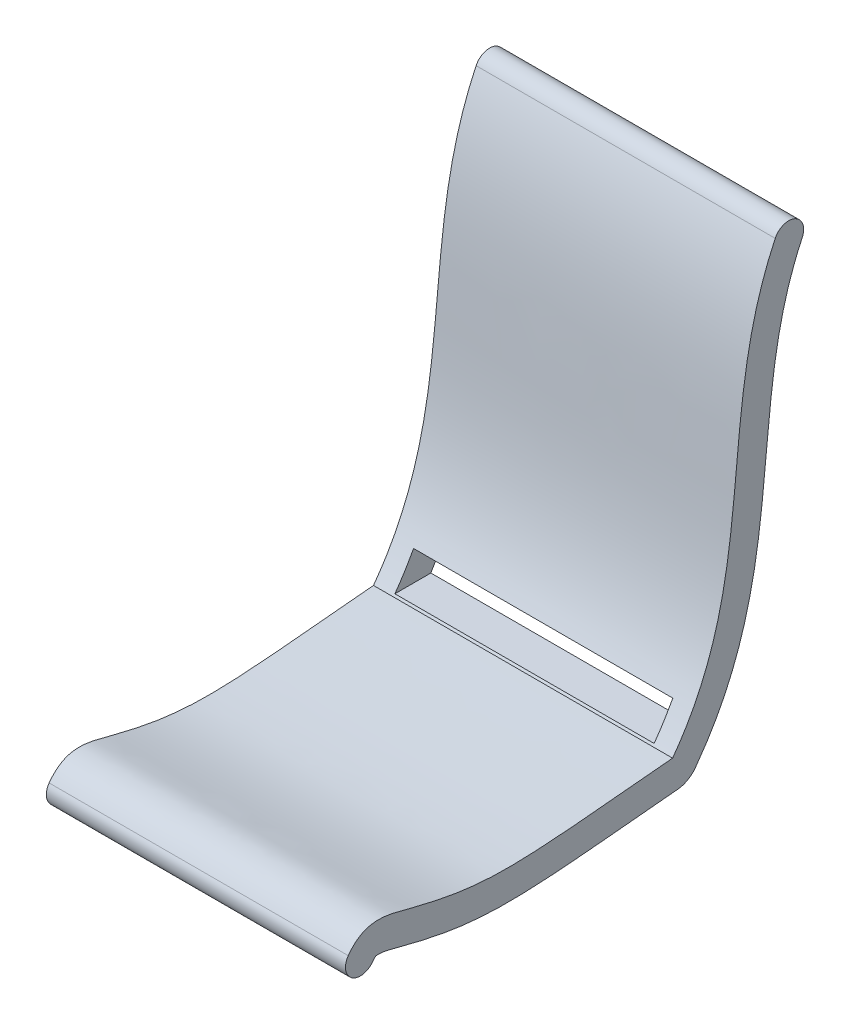
ISO-10303-21;
HEADER;
FILE_DESCRIPTION(('STEP AP214'),'2;1');
FILE_NAME('part.step','',(''),(''),'','','');
FILE_SCHEMA(('AUTOMOTIVE_DESIGN { 1 0 10303 214 1 1 1 1 }'));
ENDSEC;
DATA;
#1=APPLICATION_CONTEXT('core data for automotive mechanical design processes');
#2=APPLICATION_PROTOCOL_DEFINITION('international standard','automotive_design',2000,#1);
#3=PRODUCT_CONTEXT('',#1,'mechanical');
#4=PRODUCT('Part','Part','',(#3));
#5=PRODUCT_RELATED_PRODUCT_CATEGORY('part','',(#4));
#6=PRODUCT_DEFINITION_FORMATION('','',#4);
#7=PRODUCT_DEFINITION_CONTEXT('part definition',#1,'design');
#8=PRODUCT_DEFINITION('design','',#6,#7);
#9=PRODUCT_DEFINITION_SHAPE('','',#8);
#10=(LENGTH_UNIT() NAMED_UNIT(*) SI_UNIT(.MILLI.,.METRE.));
#11=(NAMED_UNIT(*) PLANE_ANGLE_UNIT() SI_UNIT($,.RADIAN.));
#12=(NAMED_UNIT(*) SI_UNIT($,.STERADIAN.) SOLID_ANGLE_UNIT());
#13=UNCERTAINTY_MEASURE_WITH_UNIT(LENGTH_MEASURE(1.E-05),#10,'distance_accuracy_value','');
#14=(GEOMETRIC_REPRESENTATION_CONTEXT(3) GLOBAL_UNCERTAINTY_ASSIGNED_CONTEXT((#13)) GLOBAL_UNIT_ASSIGNED_CONTEXT((#10,
#11,#12)) REPRESENTATION_CONTEXT('',''));
#15=CARTESIAN_POINT('',(0.,0.,0.));
#16=DIRECTION('',(0.,0.,1.));
#17=DIRECTION('',(1.,0.,0.));
#18=AXIS2_PLACEMENT_3D('',#15,#16,#17);
#19=CARTESIAN_POINT('',(15.,-20.5490433781008,1.25678289709263));
#20=CARTESIAN_POINT('',(15.,-22.0129074998701,16.8389596263821));
#21=CARTESIAN_POINT('',(15.,-22.6625263353804,20.2299926276296));
#22=CARTESIAN_POINT('',(15.,-19.163651430242,32.1518323068308));
#23=CARTESIAN_POINT('',(15.,-21.439258603375,33.7867881123658));
#24=B_SPLINE_CURVE_WITH_KNOTS('',3,(#19,#20,#21,#22,#23),.UNSPECIFIED.,.F.,.F.,(4,1,4),(0.,
0.814502420587084,1.),.UNSPECIFIED.);
#25=DIRECTION('',(-1.,0.,0.));
#26=VECTOR('',#25,1.);
#27=SURFACE_OF_LINEAR_EXTRUSION('',#24,#26);
#28=CARTESIAN_POINT('',(-15.,-20.5490433781008,1.25678289709263));
#29=CARTESIAN_POINT('',(-15.,-22.0129074998701,16.8389596263821));
#30=CARTESIAN_POINT('',(-15.,-22.6625263353804,20.2299926276296));
#31=CARTESIAN_POINT('',(-15.,-19.163651430242,32.1518323068308));
#32=CARTESIAN_POINT('',(-15.,-21.439258603375,33.7867881123658));
#33=B_SPLINE_CURVE_WITH_KNOTS('',3,(#28,#29,#30,#31,#32),.UNSPECIFIED.,.F.,.F.,(4,1,4),(0.,
0.814502420587084,1.),.UNSPECIFIED.);
#34=CARTESIAN_POINT('',(-15.,-20.5490433781008,1.25678289709263));
#35=VERTEX_POINT('',#34);
#36=CARTESIAN_POINT('',(-15.,-21.439258603375,33.7867881123658));
#37=VERTEX_POINT('',#36);
#38=EDGE_CURVE('E139',#35,#37,#33,.T.);
#39=ORIENTED_EDGE('',*,*,#38,.T.);
#40=DIRECTION('',(-1.,0.,0.));
#41=VECTOR('',#40,1.);
#42=CARTESIAN_POINT('',(15.,-21.439258603375,33.7867881123658));
#43=LINE('',#42,#41);
#44=CARTESIAN_POINT('',(15.,-21.439258603375,33.7867881123658));
#45=VERTEX_POINT('',#44);
#46=EDGE_CURVE('E193',#45,#37,#43,.T.);
#47=ORIENTED_EDGE('',*,*,#46,.F.);
#48=CARTESIAN_POINT('',(15.,-20.5490433781008,1.25678289709263));
#49=VERTEX_POINT('',#48);
#50=EDGE_CURVE('E148',#49,#45,#24,.T.);
#51=ORIENTED_EDGE('',*,*,#50,.F.);
#52=DIRECTION('',(-1.,0.,0.));
#53=VECTOR('',#52,1.);
#54=CARTESIAN_POINT('',(15.,-20.5490433781008,1.25678289709263));
#55=LINE('',#54,#53);
#56=EDGE_CURVE('E227',#49,#35,#55,.T.);
#57=ORIENTED_EDGE('',*,*,#56,.T.);
#58=EDGE_LOOP('',(#39,#47,#51,#57));
#59=FACE_BOUND('',#58,.T.);
#60=ADVANCED_FACE('F38',(#59),#27,.F.);
#61=CARTESIAN_POINT('',(15.,-22.3144878683215,32.5686035065768));
#62=DIRECTION('',(-1.,0.,0.));
#63=DIRECTION('',(0.,0.,1.));
#64=AXIS2_PLACEMENT_3D('',#61,#62,#63);
#65=CYLINDRICAL_SURFACE('',#64,1.5);
#66=CARTESIAN_POINT('',(-15.,-22.3144878683215,32.5686035065768));
#67=DIRECTION('',(1.,0.,0.));
#68=DIRECTION('',(0.,0.,-1.));
#69=AXIS2_PLACEMENT_3D('',#66,#67,#68);
#70=CIRCLE('',#69,1.5);
#71=CARTESIAN_POINT('',(-15.,-23.1897171332679,31.3504189007878));
#72=VERTEX_POINT('',#71);
#73=EDGE_CURVE('E142',#37,#72,#70,.T.);
#74=ORIENTED_EDGE('',*,*,#73,.T.);
#75=DIRECTION('',(-1.,0.,0.));
#76=VECTOR('',#75,1.);
#77=CARTESIAN_POINT('',(15.,-23.1897171332679,31.3504189007878));
#78=LINE('',#77,#76);
#79=CARTESIAN_POINT('',(15.,-23.1897171332679,31.3504189007878));
#80=VERTEX_POINT('',#79);
#81=EDGE_CURVE('E190',#80,#72,#78,.T.);
#82=ORIENTED_EDGE('',*,*,#81,.F.);
#83=CARTESIAN_POINT('',(15.,-22.3144878683215,32.5686035065768));
#84=DIRECTION('',(1.,0.,0.));
#85=DIRECTION('',(0.,0.,-1.));
#86=AXIS2_PLACEMENT_3D('',#83,#84,#85);
#87=CIRCLE('',#86,1.5);
#88=EDGE_CURVE('E157',#45,#80,#87,.T.);
#89=ORIENTED_EDGE('',*,*,#88,.F.);
#90=ORIENTED_EDGE('',*,*,#46,.T.);
#91=EDGE_LOOP('',(#74,#82,#89,#90));
#92=FACE_BOUND('',#91,.T.);
#93=ADVANCED_FACE('F178',(#92),#65,.T.);
#94=CARTESIAN_POINT('',(15.,-23.1897171332679,31.3504189007878));
#95=CARTESIAN_POINT('',(15.,-23.1517443867716,31.3231366162752));
#96=CARTESIAN_POINT('',(15.,-23.0711609668449,31.2610143312368));
#97=CARTESIAN_POINT('',(15.,-22.9685750350752,31.168328291419));
#98=CARTESIAN_POINT('',(15.,-22.8987472882831,31.0866780429713));
#99=CARTESIAN_POINT('',(15.,-22.8721890340848,31.0412044069542));
#100=CARTESIAN_POINT('',(15.,-22.8554965110064,31.0028148127399));
#101=CARTESIAN_POINT('',(15.,-22.820633734858,30.8770357912552));
#102=CARTESIAN_POINT('',(15.,-22.8358238885753,30.4075669321515));
#103=CARTESIAN_POINT('',(15.,-22.9800756572643,29.6829199509348));
#104=CARTESIAN_POINT('',(15.,-23.2366027384155,28.7311474522113));
#105=CARTESIAN_POINT('',(15.,-23.4924190237456,27.7371405221114));
#106=CARTESIAN_POINT('',(15.,-23.7957821377189,26.4903201298257));
#107=CARTESIAN_POINT('',(15.,-24.1223734355537,24.9965269431151));
#108=CARTESIAN_POINT('',(15.,-24.5277471644407,22.708408769443));
#109=CARTESIAN_POINT('',(15.,-24.8172861796699,19.9223058252217));
#110=CARTESIAN_POINT('',(15.,-24.841144856878,16.4265849271409));
#111=CARTESIAN_POINT('',(15.,-24.6451021374138,13.1059314679036));
#112=CARTESIAN_POINT('',(15.,-24.3854014119124,9.98955163715055));
#113=CARTESIAN_POINT('',(15.,-24.1443632825971,7.36972477291598));
#114=CARTESIAN_POINT('',(15.,-23.908012313045,4.89522712203263));
#115=CARTESIAN_POINT('',(15.,-23.7020819115245,2.73677024679048));
#116=CARTESIAN_POINT('',(15.,-23.5902206797817,1.55448918692548));
#117=CARTESIAN_POINT('',(15.,-23.5358919348432,0.976184074775645));
#118=B_SPLINE_CURVE_WITH_KNOTS('',3,(#94,#95,#96,#97,#98,#99,#100,#101,#102,#103,#104,#105,#106,
#107,#108,#109,#110,#111,#112,#113,#114,#115,#116,#117),.UNSPECIFIED.,.F.,.F.,(4,1,1,1,1,1,1,1,
1,1,1,1,1,1,1,1,1,1,1,1,1,4),(0.,0.0078125,0.015625,0.03125,0.046875,0.0625,0.09375,0.125,
0.15625,0.1875,0.21875,0.25,0.3125,0.375,0.5,0.625,0.75,0.8125,0.875,0.9375,0.96875,1.),.UNSPECIFIED.);
#119=DIRECTION('',(-1.,0.,0.));
#120=VECTOR('',#119,1.);
#121=SURFACE_OF_LINEAR_EXTRUSION('',#118,#120);
#122=CARTESIAN_POINT('',(-15.,-23.1897171332679,31.3504189007878));
#123=CARTESIAN_POINT('',(-15.,-23.1517443867716,31.3231366162752));
#124=CARTESIAN_POINT('',(-15.,-23.0711609668449,31.2610143312368));
#125=CARTESIAN_POINT('',(-15.,-22.9685750350752,31.168328291419));
#126=CARTESIAN_POINT('',(-15.,-22.8987472882831,31.0866780429713));
#127=CARTESIAN_POINT('',(-15.,-22.8721890340848,31.0412044069542));
#128=CARTESIAN_POINT('',(-15.,-22.8554965110064,31.0028148127399));
#129=CARTESIAN_POINT('',(-15.,-22.820633734858,30.8770357912552));
#130=CARTESIAN_POINT('',(-15.,-22.8358238885753,30.4075669321515));
#131=CARTESIAN_POINT('',(-15.,-22.9800756572643,29.6829199509348));
#132=CARTESIAN_POINT('',(-15.,-23.2366027384155,28.7311474522113));
#133=CARTESIAN_POINT('',(-15.,-23.4924190237456,27.7371405221114));
#134=CARTESIAN_POINT('',(-15.,-23.7957821377189,26.4903201298257));
#135=CARTESIAN_POINT('',(-15.,-24.1223734355537,24.9965269431151));
#136=CARTESIAN_POINT('',(-15.,-24.5277471644407,22.708408769443));
#137=CARTESIAN_POINT('',(-15.,-24.8172861796699,19.9223058252217));
#138=CARTESIAN_POINT('',(-15.,-24.841144856878,16.4265849271409));
#139=CARTESIAN_POINT('',(-15.,-24.6451021374138,13.1059314679036));
#140=CARTESIAN_POINT('',(-15.,-24.3854014119124,9.98955163715055));
#141=CARTESIAN_POINT('',(-15.,-24.1443632825971,7.36972477291598));
#142=CARTESIAN_POINT('',(-15.,-23.908012313045,4.89522712203263));
#143=CARTESIAN_POINT('',(-15.,-23.7020819115245,2.73677024679048));
#144=CARTESIAN_POINT('',(-15.,-23.5902206797817,1.55448918692548));
#145=CARTESIAN_POINT('',(-15.,-23.5358919348432,0.976184074775645));
#146=B_SPLINE_CURVE_WITH_KNOTS('',3,(#122,#123,#124,#125,#126,#127,#128,#129,#130,#131,#132,
#133,#134,#135,#136,#137,#138,#139,#140,#141,#142,#143,#144,#145),.UNSPECIFIED.,.F.,.F.,(4,1,1,
1,1,1,1,1,1,1,1,1,1,1,1,1,1,1,1,1,1,4),(0.,0.0078125,0.015625,0.03125,0.046875,0.0625,0.09375,
0.125,0.15625,0.1875,0.21875,0.25,0.3125,0.375,0.5,0.625,0.75,0.8125,0.875,0.9375,0.96875,1.),.UNSPECIFIED.);
#147=CARTESIAN_POINT('',(-15.,-23.5358919348432,0.976184074775645));
#148=VERTEX_POINT('',#147);
#149=EDGE_CURVE('E197',#72,#148,#146,.T.);
#150=ORIENTED_EDGE('',*,*,#149,.T.);
#151=DIRECTION('',(-1.,0.,0.));
#152=VECTOR('',#151,1.);
#153=CARTESIAN_POINT('',(15.,-23.5358919348432,0.976184074775645));
#154=LINE('',#153,#152);
#155=CARTESIAN_POINT('',(15.,-23.5358919348432,0.976184074775645));
#156=VERTEX_POINT('',#155);
#157=EDGE_CURVE('E201',#156,#148,#154,.T.);
#158=ORIENTED_EDGE('',*,*,#157,.F.);
#159=EDGE_CURVE('E163',#80,#156,#118,.T.);
#160=ORIENTED_EDGE('',*,*,#159,.F.);
#161=ORIENTED_EDGE('',*,*,#81,.T.);
#162=EDGE_LOOP('',(#150,#158,#160,#161));
#163=FACE_BOUND('',#162,.T.);
#164=ADVANCED_FACE('F174',(#163),#121,.F.);
#165=CARTESIAN_POINT('',(15.,-20.9961974844615,1.00398705363008));
#166=DIRECTION('',(-1.,0.,0.));
#167=DIRECTION('',(0.,0.,1.));
#168=AXIS2_PLACEMENT_3D('',#165,#166,#167);
#169=CYLINDRICAL_SURFACE('',#168,2.5398466305926);
#170=CARTESIAN_POINT('',(-15.,-20.9961974844615,1.00398705363008));
#171=DIRECTION('',(1.,0.,0.));
#172=DIRECTION('',(0.,0.,-1.));
#173=AXIS2_PLACEMENT_3D('',#170,#171,#172);
#174=CIRCLE('',#173,2.5398466305926);
#175=CARTESIAN_POINT('',(-15.,-22.3294738286493,-1.15777035573898));
#176=VERTEX_POINT('',#175);
#177=EDGE_CURVE('E206',#148,#176,#174,.T.);
#178=ORIENTED_EDGE('',*,*,#177,.T.);
#179=DIRECTION('',(-1.,0.,0.));
#180=VECTOR('',#179,1.);
#181=CARTESIAN_POINT('',(15.,-22.3294738286493,-1.15777035573898));
#182=LINE('',#181,#180);
#183=CARTESIAN_POINT('',(15.,-22.3294738286493,-1.15777035573898));
#184=VERTEX_POINT('',#183);
#185=EDGE_CURVE('E240',#184,#176,#182,.T.);
#186=ORIENTED_EDGE('',*,*,#185,.F.);
#187=CARTESIAN_POINT('',(15.,-20.9961974844615,1.00398705363008));
#188=DIRECTION('',(1.,0.,0.));
#189=DIRECTION('',(0.,0.,-1.));
#190=AXIS2_PLACEMENT_3D('',#187,#188,#189);
#191=CIRCLE('',#190,2.5398466305926);
#192=EDGE_CURVE('E168',#156,#184,#191,.T.);
#193=ORIENTED_EDGE('',*,*,#192,.F.);
#194=ORIENTED_EDGE('',*,*,#157,.T.);
#195=EDGE_LOOP('',(#178,#186,#193,#194));
#196=FACE_BOUND('',#195,.T.);
#197=ADVANCED_FACE('F177',(#196),#169,.T.);
#198=CARTESIAN_POINT('',(15.,-22.3294738286493,-1.15777035573898));
#199=CARTESIAN_POINT('',(15.,-21.9147039738976,-1.46361114782068));
#200=CARTESIAN_POINT('',(15.,-21.0624637332876,-2.05754770960488));
#201=CARTESIAN_POINT('',(15.,-19.3490516846433,-3.12170236513787));
#202=CARTESIAN_POINT('',(15.,-17.162107059532,-4.25604012617825));
#203=CARTESIAN_POINT('',(15.,-14.5002042028041,-5.33131890104861));
#204=CARTESIAN_POINT('',(15.,-10.9236629637538,-6.44077873172351));
#205=CARTESIAN_POINT('',(15.,-6.44457872835347,-7.32664865520031));
#206=CARTESIAN_POINT('',(15.,0.627149111461741,-8.1281695912789));
#207=CARTESIAN_POINT('',(15.,9.15162752730583,-8.78343847145013));
#208=CARTESIAN_POINT('',(15.,15.2811180378444,-10.3723520832333));
#209=CARTESIAN_POINT('',(15.,18.1605468772279,-11.7443030248053));
#210=B_SPLINE_CURVE_WITH_KNOTS('',3,(#198,#199,#200,#201,#202,#203,#204,#205,#206,#207,#208,
#209),.UNSPECIFIED.,.F.,.F.,(4,1,1,1,1,1,1,1,1,4),(0.,0.03125,0.0625,0.125,0.1875,0.25,0.375,
0.5,0.75,1.),.UNSPECIFIED.);
#211=DIRECTION('',(-1.,0.,0.));
#212=VECTOR('',#211,1.);
#213=SURFACE_OF_LINEAR_EXTRUSION('',#210,#212);
#214=DIRECTION('',(-1.,0.,0.));
#215=VECTOR('',#214,1.);
#216=CARTESIAN_POINT('',(15.,-17.3471005419117,-4.11943670982298));
#217=LINE('',#216,#215);
#218=CARTESIAN_POINT('',(13.,-17.3471005419117,-4.11943670982512));
#219=VERTEX_POINT('',#218);
#220=CARTESIAN_POINT('',(-13.,-17.3471005419117,-4.11943670982298));
#221=VERTEX_POINT('',#220);
#222=EDGE_CURVE('E138',#219,#221,#217,.T.);
#223=ORIENTED_EDGE('',*,*,#222,.T.);
#224=CARTESIAN_POINT('',(-13.,-22.3294738286493,-1.15777035573898));
#225=CARTESIAN_POINT('',(-13.,-21.9147039738976,-1.46361114782068));
#226=CARTESIAN_POINT('',(-13.,-21.0624637332876,-2.05754770960488));
#227=CARTESIAN_POINT('',(-13.,-19.3490516846433,-3.12170236513787));
#228=CARTESIAN_POINT('',(-13.,-17.162107059532,-4.25604012617825));
#229=CARTESIAN_POINT('',(-13.,-14.5002042028041,-5.33131890104861));
#230=CARTESIAN_POINT('',(-13.,-10.9236629637538,-6.44077873172351));
#231=CARTESIAN_POINT('',(-13.,-6.44457872835347,-7.32664865520031));
#232=CARTESIAN_POINT('',(-13.,0.627149111461741,-8.1281695912789));
#233=CARTESIAN_POINT('',(-13.,9.15162752730583,-8.78343847145013));
#234=CARTESIAN_POINT('',(-13.,15.2811180378444,-10.3723520832333));
#235=CARTESIAN_POINT('',(-13.,18.1605468772279,-11.7443030248053));
#236=B_SPLINE_CURVE_WITH_KNOTS('',3,(#224,#225,#226,#227,#228,#229,#230,#231,#232,#233,#234,
#235),.UNSPECIFIED.,.F.,.F.,(4,1,1,1,1,1,1,1,1,4),(0.,0.03125,0.0625,0.125,0.1875,0.25,0.375,
0.5,0.75,1.),.UNSPECIFIED.);
#237=CARTESIAN_POINT('',(-13.,-20.3471005419117,-2.49785984424331));
#238=VERTEX_POINT('',#237);
#239=EDGE_CURVE('E131',#221,#238,#236,.F.);
#240=ORIENTED_EDGE('',*,*,#239,.T.);
#241=DIRECTION('',(-1.,0.,0.));
#242=VECTOR('',#241,1.);
#243=CARTESIAN_POINT('',(15.,-20.3471005419117,-2.49785984424331));
#244=LINE('',#243,#242);
#245=CARTESIAN_POINT('',(13.,-20.3471005419117,-2.49785984424331));
#246=VERTEX_POINT('',#245);
#247=EDGE_CURVE('E120',#238,#246,#244,.F.);
#248=ORIENTED_EDGE('',*,*,#247,.T.);
#249=CARTESIAN_POINT('',(13.,-22.3294738286493,-1.15777035573898));
#250=CARTESIAN_POINT('',(13.,-21.9147039738976,-1.46361114782068));
#251=CARTESIAN_POINT('',(13.,-21.0624637332876,-2.05754770960488));
#252=CARTESIAN_POINT('',(13.,-19.3490516846433,-3.12170236513787));
#253=CARTESIAN_POINT('',(13.,-17.162107059532,-4.25604012617825));
#254=CARTESIAN_POINT('',(13.,-14.5002042028041,-5.33131890104861));
#255=CARTESIAN_POINT('',(13.,-10.9236629637538,-6.44077873172351));
#256=CARTESIAN_POINT('',(13.,-6.44457872835347,-7.32664865520031));
#257=CARTESIAN_POINT('',(13.,0.627149111461741,-8.1281695912789));
#258=CARTESIAN_POINT('',(13.,9.15162752730583,-8.78343847145013));
#259=CARTESIAN_POINT('',(13.,15.2811180378444,-10.3723520832333));
#260=CARTESIAN_POINT('',(13.,18.1605468772279,-11.7443030248053));
#261=B_SPLINE_CURVE_WITH_KNOTS('',3,(#249,#250,#251,#252,#253,#254,#255,#256,#257,#258,#259,
#260),.UNSPECIFIED.,.F.,.F.,(4,1,1,1,1,1,1,1,1,4),(0.,0.03125,0.0625,0.125,0.1875,0.25,0.375,
0.5,0.75,1.),.UNSPECIFIED.);
#262=EDGE_CURVE('E125',#246,#219,#261,.T.);
#263=ORIENTED_EDGE('',*,*,#262,.T.);
#264=EDGE_LOOP('',(#223,#240,#248,#263));
#265=FACE_BOUND('',#264,.T.);
#266=CARTESIAN_POINT('',(-15.,-22.3294738286493,-1.15777035573898));
#267=CARTESIAN_POINT('',(-15.,-21.9147039738976,-1.46361114782068));
#268=CARTESIAN_POINT('',(-15.,-21.0624637332876,-2.05754770960488));
#269=CARTESIAN_POINT('',(-15.,-19.3490516846433,-3.12170236513787));
#270=CARTESIAN_POINT('',(-15.,-17.162107059532,-4.25604012617825));
#271=CARTESIAN_POINT('',(-15.,-14.5002042028041,-5.33131890104861));
#272=CARTESIAN_POINT('',(-15.,-10.9236629637538,-6.44077873172351));
#273=CARTESIAN_POINT('',(-15.,-6.44457872835347,-7.32664865520031));
#274=CARTESIAN_POINT('',(-15.,0.627149111461741,-8.1281695912789));
#275=CARTESIAN_POINT('',(-15.,9.15162752730583,-8.78343847145013));
#276=CARTESIAN_POINT('',(-15.,15.2811180378444,-10.3723520832333));
#277=CARTESIAN_POINT('',(-15.,18.1605468772279,-11.7443030248053));
#278=B_SPLINE_CURVE_WITH_KNOTS('',3,(#266,#267,#268,#269,#270,#271,#272,#273,#274,#275,#276,
#277),.UNSPECIFIED.,.F.,.F.,(4,1,1,1,1,1,1,1,1,4),(0.,0.03125,0.0625,0.125,0.1875,0.25,0.375,
0.5,0.75,1.),.UNSPECIFIED.);
#279=CARTESIAN_POINT('',(-15.,18.1605468772279,-11.7443030248053));
#280=VERTEX_POINT('',#279);
#281=EDGE_CURVE('E208',#176,#280,#278,.T.);
#282=ORIENTED_EDGE('',*,*,#281,.T.);
#283=DIRECTION('',(-1.,0.,0.));
#284=VECTOR('',#283,1.);
#285=CARTESIAN_POINT('',(15.,18.1605468772279,-11.7443030248053));
#286=LINE('',#285,#284);
#287=CARTESIAN_POINT('',(15.,18.1605468772279,-11.7443030248053));
#288=VERTEX_POINT('',#287);
#289=EDGE_CURVE('E237',#288,#280,#286,.T.);
#290=ORIENTED_EDGE('',*,*,#289,.F.);
#291=EDGE_CURVE('E307',#184,#288,#210,.T.);
#292=ORIENTED_EDGE('',*,*,#291,.F.);
#293=ORIENTED_EDGE('',*,*,#185,.T.);
#294=EDGE_LOOP('',(#282,#290,#292,#293));
#295=FACE_BOUND('',#294,.T.);
#296=ADVANCED_FACE('F136',(#265,#295),#213,.F.);
#297=CARTESIAN_POINT('',(15.,18.8057517495636,-10.3901572894008));
#298=DIRECTION('',(-1.,0.,0.));
#299=DIRECTION('',(0.,0.,1.));
#300=AXIS2_PLACEMENT_3D('',#297,#298,#299);
#301=CYLINDRICAL_SURFACE('',#300,1.5);
#302=CARTESIAN_POINT('',(-15.,18.8057517495636,-10.3901572894008));
#303=DIRECTION('',(1.,0.,0.));
#304=DIRECTION('',(0.,0.,1.));
#305=AXIS2_PLACEMENT_3D('',#302,#303,#304);
#306=CIRCLE('',#305,1.5);
#307=CARTESIAN_POINT('',(-15.,19.4509566218992,-9.03601155399622));
#308=VERTEX_POINT('',#307);
#309=EDGE_CURVE('E219',#280,#308,#306,.T.);
#310=ORIENTED_EDGE('',*,*,#309,.T.);
#311=DIRECTION('',(-1.,0.,0.));
#312=VECTOR('',#311,1.);
#313=CARTESIAN_POINT('',(15.,19.4509566218992,-9.03601155399622));
#314=LINE('',#313,#312);
#315=CARTESIAN_POINT('',(15.,19.4509566218992,-9.03601155399622));
#316=VERTEX_POINT('',#315);
#317=EDGE_CURVE('E233',#316,#308,#314,.T.);
#318=ORIENTED_EDGE('',*,*,#317,.F.);
#319=CARTESIAN_POINT('',(15.,18.8057517495636,-10.3901572894008));
#320=DIRECTION('',(1.,0.,0.));
#321=DIRECTION('',(0.,0.,1.));
#322=AXIS2_PLACEMENT_3D('',#319,#320,#321);
#323=CIRCLE('',#322,1.5);
#324=EDGE_CURVE('E298',#288,#316,#323,.T.);
#325=ORIENTED_EDGE('',*,*,#324,.F.);
#326=ORIENTED_EDGE('',*,*,#289,.T.);
#327=EDGE_LOOP('',(#310,#318,#325,#326));
#328=FACE_BOUND('',#327,.T.);
#329=ADVANCED_FACE('F293',(#328),#301,.T.);
#330=CARTESIAN_POINT('',(15.,19.4509566218992,-9.03601155399622));
#331=CARTESIAN_POINT('',(15.,6.57765412179561,-2.90231613336552));
#332=CARTESIAN_POINT('',(15.,-8.50477249803661,-7.62435758070493));
#333=CARTESIAN_POINT('',(15.,-20.5490433781008,1.25678289709263));
#334=B_SPLINE_CURVE_WITH_KNOTS('',3,(#330,#331,#332,#333),.UNSPECIFIED.,.F.,.F.,(4,4),(0.,1.),.UNSPECIFIED.);
#335=DIRECTION('',(-1.,0.,0.));
#336=VECTOR('',#335,1.);
#337=SURFACE_OF_LINEAR_EXTRUSION('',#334,#336);
#338=DIRECTION('',(-1.,0.,0.));
#339=VECTOR('',#338,1.);
#340=CARTESIAN_POINT('',(15.,-20.3471005419117,1.10935092885513));
#341=LINE('',#340,#339);
#342=CARTESIAN_POINT('',(13.,-20.3471005419117,1.10935092885513));
#343=VERTEX_POINT('',#342);
#344=CARTESIAN_POINT('',(-13.,-20.3471005419117,1.10935092885513));
#345=VERTEX_POINT('',#344);
#346=EDGE_CURVE('E245',#343,#345,#341,.T.);
#347=ORIENTED_EDGE('',*,*,#346,.T.);
#348=CARTESIAN_POINT('',(-13.,19.4509566218992,-9.03601155399622));
#349=CARTESIAN_POINT('',(-13.,6.57765412179561,-2.90231613336552));
#350=CARTESIAN_POINT('',(-13.,-8.50477249803661,-7.62435758070493));
#351=CARTESIAN_POINT('',(-13.,-20.5490433781008,1.25678289709263));
#352=B_SPLINE_CURVE_WITH_KNOTS('',3,(#348,#349,#350,#351),.UNSPECIFIED.,.F.,.F.,(4,4),(0.,1.),.UNSPECIFIED.);
#353=CARTESIAN_POINT('',(-13.,-17.3471005419117,-0.764593586237583));
#354=VERTEX_POINT('',#353);
#355=EDGE_CURVE('E11',#345,#354,#352,.F.);
#356=ORIENTED_EDGE('',*,*,#355,.T.);
#357=DIRECTION('',(-1.,0.,0.));
#358=VECTOR('',#357,1.);
#359=CARTESIAN_POINT('',(15.,-17.3471005419117,-0.764593586237583));
#360=LINE('',#359,#358);
#361=CARTESIAN_POINT('',(13.,-17.3471005419117,-0.764593591454444));
#362=VERTEX_POINT('',#361);
#363=EDGE_CURVE('E48',#354,#362,#360,.F.);
#364=ORIENTED_EDGE('',*,*,#363,.T.);
#365=CARTESIAN_POINT('',(13.,19.4509566218992,-9.03601155399622));
#366=CARTESIAN_POINT('',(13.,6.57765412179561,-2.90231613336552));
#367=CARTESIAN_POINT('',(13.,-8.50477249803661,-7.62435758070493));
#368=CARTESIAN_POINT('',(13.,-20.5490433781008,1.25678289709263));
#369=B_SPLINE_CURVE_WITH_KNOTS('',3,(#365,#366,#367,#368),.UNSPECIFIED.,.F.,.F.,(4,4),(0.,1.),.UNSPECIFIED.);
#370=EDGE_CURVE('E247',#362,#343,#369,.T.);
#371=ORIENTED_EDGE('',*,*,#370,.T.);
#372=EDGE_LOOP('',(#347,#356,#364,#371));
#373=FACE_BOUND('',#372,.T.);
#374=CARTESIAN_POINT('',(-15.,19.4509566218992,-9.03601155399622));
#375=CARTESIAN_POINT('',(-15.,6.57765412179561,-2.90231613336552));
#376=CARTESIAN_POINT('',(-15.,-8.50477249803661,-7.62435758070493));
#377=CARTESIAN_POINT('',(-15.,-20.5490433781008,1.25678289709263));
#378=B_SPLINE_CURVE_WITH_KNOTS('',3,(#374,#375,#376,#377),.UNSPECIFIED.,.F.,.F.,(4,4),(0.,1.),.UNSPECIFIED.);
#379=EDGE_CURVE('E158',#308,#35,#378,.T.);
#380=ORIENTED_EDGE('',*,*,#379,.T.);
#381=ORIENTED_EDGE('',*,*,#56,.F.);
#382=EDGE_CURVE('E234',#316,#49,#334,.T.);
#383=ORIENTED_EDGE('',*,*,#382,.F.);
#384=ORIENTED_EDGE('',*,*,#317,.T.);
#385=EDGE_LOOP('',(#380,#381,#383,#384));
#386=FACE_BOUND('',#385,.T.);
#387=ADVANCED_FACE('F256',(#373,#386),#337,.F.);
#388=CARTESIAN_POINT('',(15.,-21.7677456239999,19.7346548301492));
#389=DIRECTION('',(-1.,0.,0.));
#390=DIRECTION('',(0.,0.,1.));
#391=AXIS2_PLACEMENT_3D('',#388,#389,#390);
#392=PLANE('',#391);
#393=ORIENTED_EDGE('',*,*,#50,.T.);
#394=ORIENTED_EDGE('',*,*,#88,.T.);
#395=ORIENTED_EDGE('',*,*,#159,.T.);
#396=ORIENTED_EDGE('',*,*,#192,.T.);
#397=ORIENTED_EDGE('',*,*,#291,.T.);
#398=ORIENTED_EDGE('',*,*,#324,.T.);
#399=ORIENTED_EDGE('',*,*,#382,.T.);
#400=EDGE_LOOP('',(#393,#394,#395,#396,#397,#398,#399));
#401=FACE_BOUND('',#400,.T.);
#402=ADVANCED_FACE('F284',(#401),#392,.F.);
#403=CARTESIAN_POINT('',(-15.,-21.7677456239999,19.7346548301492));
#404=DIRECTION('',(-1.,0.,0.));
#405=DIRECTION('',(0.,0.,1.));
#406=AXIS2_PLACEMENT_3D('',#403,#404,#405);
#407=PLANE('',#406);
#408=ORIENTED_EDGE('',*,*,#38,.F.);
#409=ORIENTED_EDGE('',*,*,#379,.F.);
#410=ORIENTED_EDGE('',*,*,#309,.F.);
#411=ORIENTED_EDGE('',*,*,#281,.F.);
#412=ORIENTED_EDGE('',*,*,#177,.F.);
#413=ORIENTED_EDGE('',*,*,#149,.F.);
#414=ORIENTED_EDGE('',*,*,#73,.F.);
#415=EDGE_LOOP('',(#408,#409,#410,#411,#412,#413,#414));
#416=FACE_BOUND('',#415,.T.);
#417=ADVANCED_FACE('F204',(#416),#407,.T.);
#418=CARTESIAN_POINT('',(-13.,-20.3471005419117,-5.));
#419=DIRECTION('',(-1.,0.,0.));
#420=DIRECTION('',(0.,0.,1.));
#421=AXIS2_PLACEMENT_3D('',#418,#419,#420);
#422=PLANE('',#421);
#423=DIRECTION('',(0.,0.,1.));
#424=VECTOR('',#423,1.);
#425=CARTESIAN_POINT('',(-13.,-17.3471005419117,-5.));
#426=LINE('',#425,#424);
#427=EDGE_CURVE('E126',#221,#354,#426,.T.);
#428=ORIENTED_EDGE('',*,*,#427,.T.);
#429=ORIENTED_EDGE('',*,*,#355,.F.);
#430=DIRECTION('',(0.,0.,1.));
#431=VECTOR('',#430,1.);
#432=CARTESIAN_POINT('',(-13.,-20.3471005419117,-5.));
#433=LINE('',#432,#431);
#434=EDGE_CURVE('E60',#238,#345,#433,.T.);
#435=ORIENTED_EDGE('',*,*,#434,.F.);
#436=ORIENTED_EDGE('',*,*,#239,.F.);
#437=EDGE_LOOP('',(#428,#429,#435,#436));
#438=FACE_BOUND('',#437,.T.);
#439=ADVANCED_FACE('F130',(#438),#422,.F.);
#440=CARTESIAN_POINT('',(-13.,-17.3471005419117,-5.));
#441=DIRECTION('',(0.,1.,0.));
#442=DIRECTION('',(0.,0.,1.));
#443=AXIS2_PLACEMENT_3D('',#440,#441,#442);
#444=PLANE('',#443);
#445=DIRECTION('',(0.,0.,1.));
#446=VECTOR('',#445,1.);
#447=CARTESIAN_POINT('',(13.,-17.3471005419117,-5.));
#448=LINE('',#447,#446);
#449=EDGE_CURVE('E262',#219,#362,#448,.T.);
#450=ORIENTED_EDGE('',*,*,#449,.T.);
#451=ORIENTED_EDGE('',*,*,#363,.F.);
#452=ORIENTED_EDGE('',*,*,#427,.F.);
#453=ORIENTED_EDGE('',*,*,#222,.F.);
#454=EDGE_LOOP('',(#450,#451,#452,#453));
#455=FACE_BOUND('',#454,.T.);
#456=ADVANCED_FACE('F260',(#455),#444,.F.);
#457=CARTESIAN_POINT('',(13.,-20.3471005419117,-5.));
#458=DIRECTION('',(1.,0.,0.));
#459=DIRECTION('',(0.,0.,-1.));
#460=AXIS2_PLACEMENT_3D('',#457,#458,#459);
#461=PLANE('',#460);
#462=DIRECTION('',(0.,0.,1.));
#463=VECTOR('',#462,1.);
#464=CARTESIAN_POINT('',(13.,-20.3471005419117,-5.));
#465=LINE('',#464,#463);
#466=EDGE_CURVE('E55',#246,#343,#465,.T.);
#467=ORIENTED_EDGE('',*,*,#466,.T.);
#468=ORIENTED_EDGE('',*,*,#370,.F.);
#469=ORIENTED_EDGE('',*,*,#449,.F.);
#470=ORIENTED_EDGE('',*,*,#262,.F.);
#471=EDGE_LOOP('',(#467,#468,#469,#470));
#472=FACE_BOUND('',#471,.T.);
#473=ADVANCED_FACE('F272',(#472),#461,.F.);
#474=CARTESIAN_POINT('',(-13.,-20.3471005419117,-5.));
#475=DIRECTION('',(0.,-1.,0.));
#476=DIRECTION('',(0.,0.,-1.));
#477=AXIS2_PLACEMENT_3D('',#474,#475,#476);
#478=PLANE('',#477);
#479=ORIENTED_EDGE('',*,*,#434,.T.);
#480=ORIENTED_EDGE('',*,*,#346,.F.);
#481=ORIENTED_EDGE('',*,*,#466,.F.);
#482=ORIENTED_EDGE('',*,*,#247,.F.);
#483=EDGE_LOOP('',(#479,#480,#481,#482));
#484=FACE_BOUND('',#483,.T.);
#485=ADVANCED_FACE('F121',(#484),#478,.F.);
#486=CLOSED_SHELL('',(#60,#93,#164,#197,#296,#329,#387,#402,#417,#439,#456,#473,#485));
#487=MANIFOLD_SOLID_BREP('B2',#486);
#488=ADVANCED_BREP_SHAPE_REPRESENTATION('',(#18,#487),#14);
#489=SHAPE_DEFINITION_REPRESENTATION(#9,#488);
ENDSEC;
END-ISO-10303-21;
